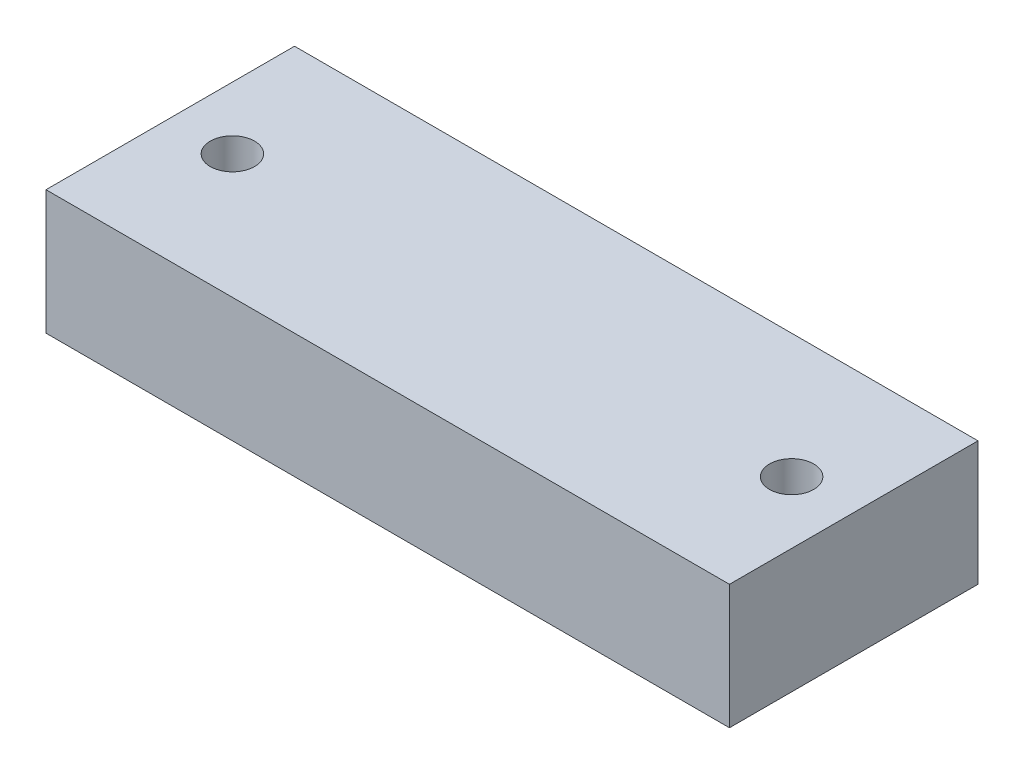
ISO-10303-21;
HEADER;
FILE_DESCRIPTION(('STEP AP214'),'2;1');
FILE_NAME('part.step','',(''),(''),'','','');
FILE_SCHEMA(('AUTOMOTIVE_DESIGN { 1 0 10303 214 1 1 1 1 }'));
ENDSEC;
DATA;
#1=APPLICATION_CONTEXT('core data for automotive mechanical design processes');
#2=APPLICATION_PROTOCOL_DEFINITION('international standard','automotive_design',2000,#1);
#3=PRODUCT_CONTEXT('',#1,'mechanical');
#4=PRODUCT('Part','Part','',(#3));
#5=PRODUCT_RELATED_PRODUCT_CATEGORY('part','',(#4));
#6=PRODUCT_DEFINITION_FORMATION('','',#4);
#7=PRODUCT_DEFINITION_CONTEXT('part definition',#1,'design');
#8=PRODUCT_DEFINITION('design','',#6,#7);
#9=PRODUCT_DEFINITION_SHAPE('','',#8);
#10=(LENGTH_UNIT() NAMED_UNIT(*) SI_UNIT(.MILLI.,.METRE.));
#11=(NAMED_UNIT(*) PLANE_ANGLE_UNIT() SI_UNIT($,.RADIAN.));
#12=(NAMED_UNIT(*) SI_UNIT($,.STERADIAN.) SOLID_ANGLE_UNIT());
#13=UNCERTAINTY_MEASURE_WITH_UNIT(LENGTH_MEASURE(1.E-05),#10,'distance_accuracy_value','');
#14=(GEOMETRIC_REPRESENTATION_CONTEXT(3) GLOBAL_UNCERTAINTY_ASSIGNED_CONTEXT((#13)) GLOBAL_UNIT_ASSIGNED_CONTEXT((#10,
#11,#12)) REPRESENTATION_CONTEXT('',''));
#15=CARTESIAN_POINT('',(0.,0.,0.));
#16=DIRECTION('',(0.,0.,1.));
#17=DIRECTION('',(1.,0.,0.));
#18=AXIS2_PLACEMENT_3D('',#15,#16,#17);
#19=CARTESIAN_POINT('',(17.4625,6.35,-6.35));
#20=DIRECTION('',(-1.,0.,0.));
#21=DIRECTION('',(0.,0.,1.));
#22=AXIS2_PLACEMENT_3D('',#19,#20,#21);
#23=PLANE('',#22);
#24=DIRECTION('',(0.,0.,-1.));
#25=VECTOR('',#24,1.);
#26=CARTESIAN_POINT('',(17.4625,0.,-6.35));
#27=LINE('',#26,#25);
#28=CARTESIAN_POINT('',(17.4625,0.,6.35));
#29=VERTEX_POINT('',#28);
#30=CARTESIAN_POINT('',(17.4625,0.,-6.35));
#31=VERTEX_POINT('',#30);
#32=EDGE_CURVE('E100',#29,#31,#27,.T.);
#33=ORIENTED_EDGE('',*,*,#32,.T.);
#34=DIRECTION('',(0.,-1.,0.));
#35=VECTOR('',#34,1.);
#36=CARTESIAN_POINT('',(17.4625,6.35,-6.35));
#37=LINE('',#36,#35);
#38=CARTESIAN_POINT('',(17.4625,6.35,-6.35));
#39=VERTEX_POINT('',#38);
#40=EDGE_CURVE('E11',#39,#31,#37,.T.);
#41=ORIENTED_EDGE('',*,*,#40,.F.);
#42=DIRECTION('',(0.,0.,-1.));
#43=VECTOR('',#42,1.);
#44=CARTESIAN_POINT('',(17.4625,6.35,-6.35));
#45=LINE('',#44,#43);
#46=CARTESIAN_POINT('',(17.4625,6.35,6.35));
#47=VERTEX_POINT('',#46);
#48=EDGE_CURVE('E88',#47,#39,#45,.T.);
#49=ORIENTED_EDGE('',*,*,#48,.F.);
#50=DIRECTION('',(0.,-1.,0.));
#51=VECTOR('',#50,1.);
#52=CARTESIAN_POINT('',(17.4625,6.35,6.35));
#53=LINE('',#52,#51);
#54=EDGE_CURVE('E96',#47,#29,#53,.T.);
#55=ORIENTED_EDGE('',*,*,#54,.T.);
#56=EDGE_LOOP('',(#33,#41,#49,#55));
#57=FACE_BOUND('',#56,.T.);
#58=ADVANCED_FACE('F37',(#57),#23,.F.);
#59=CARTESIAN_POINT('',(-17.4625,6.35,-6.35));
#60=DIRECTION('',(0.,0.,1.));
#61=DIRECTION('',(1.,0.,0.));
#62=AXIS2_PLACEMENT_3D('',#59,#60,#61);
#63=PLANE('',#62);
#64=DIRECTION('',(-1.,0.,0.));
#65=VECTOR('',#64,1.);
#66=CARTESIAN_POINT('',(-17.4625,0.,-6.35));
#67=LINE('',#66,#65);
#68=CARTESIAN_POINT('',(-17.4625,0.,-6.35));
#69=VERTEX_POINT('',#68);
#70=EDGE_CURVE('E92',#31,#69,#67,.T.);
#71=ORIENTED_EDGE('',*,*,#70,.T.);
#72=DIRECTION('',(0.,-1.,0.));
#73=VECTOR('',#72,1.);
#74=CARTESIAN_POINT('',(-17.4625,6.35,-6.35));
#75=LINE('',#74,#73);
#76=CARTESIAN_POINT('',(-17.4625,6.35,-6.35));
#77=VERTEX_POINT('',#76);
#78=EDGE_CURVE('E45',#77,#69,#75,.T.);
#79=ORIENTED_EDGE('',*,*,#78,.F.);
#80=DIRECTION('',(-1.,0.,0.));
#81=VECTOR('',#80,1.);
#82=CARTESIAN_POINT('',(-17.4625,6.35,-6.35));
#83=LINE('',#82,#81);
#84=EDGE_CURVE('E83',#39,#77,#83,.T.);
#85=ORIENTED_EDGE('',*,*,#84,.F.);
#86=ORIENTED_EDGE('',*,*,#40,.T.);
#87=EDGE_LOOP('',(#71,#79,#85,#86));
#88=FACE_BOUND('',#87,.T.);
#89=ADVANCED_FACE('F91',(#88),#63,.F.);
#90=CARTESIAN_POINT('',(-17.4625,6.35,-6.35));
#91=DIRECTION('',(1.,0.,0.));
#92=DIRECTION('',(0.,0.,-1.));
#93=AXIS2_PLACEMENT_3D('',#90,#91,#92);
#94=PLANE('',#93);
#95=DIRECTION('',(0.,0.,1.));
#96=VECTOR('',#95,1.);
#97=CARTESIAN_POINT('',(-17.4625,0.,-6.35));
#98=LINE('',#97,#96);
#99=CARTESIAN_POINT('',(-17.4625,0.,6.35));
#100=VERTEX_POINT('',#99);
#101=EDGE_CURVE('E70',#69,#100,#98,.T.);
#102=ORIENTED_EDGE('',*,*,#101,.T.);
#103=DIRECTION('',(0.,-1.,0.));
#104=VECTOR('',#103,1.);
#105=CARTESIAN_POINT('',(-17.4625,6.35,6.35));
#106=LINE('',#105,#104);
#107=CARTESIAN_POINT('',(-17.4625,6.35,6.35));
#108=VERTEX_POINT('',#107);
#109=EDGE_CURVE('E93',#108,#100,#106,.T.);
#110=ORIENTED_EDGE('',*,*,#109,.F.);
#111=DIRECTION('',(0.,0.,1.));
#112=VECTOR('',#111,1.);
#113=CARTESIAN_POINT('',(-17.4625,6.35,-6.35));
#114=LINE('',#113,#112);
#115=EDGE_CURVE('E86',#77,#108,#114,.T.);
#116=ORIENTED_EDGE('',*,*,#115,.F.);
#117=ORIENTED_EDGE('',*,*,#78,.T.);
#118=EDGE_LOOP('',(#102,#110,#116,#117));
#119=FACE_BOUND('',#118,.T.);
#120=ADVANCED_FACE('F94',(#119),#94,.F.);
#121=CARTESIAN_POINT('',(-17.4625,6.35,6.35));
#122=DIRECTION('',(0.,0.,-1.));
#123=DIRECTION('',(-1.,0.,0.));
#124=AXIS2_PLACEMENT_3D('',#121,#122,#123);
#125=PLANE('',#124);
#126=DIRECTION('',(1.,0.,0.));
#127=VECTOR('',#126,1.);
#128=CARTESIAN_POINT('',(-17.4625,0.,6.35));
#129=LINE('',#128,#127);
#130=EDGE_CURVE('E76',#100,#29,#129,.T.);
#131=ORIENTED_EDGE('',*,*,#130,.T.);
#132=ORIENTED_EDGE('',*,*,#54,.F.);
#133=DIRECTION('',(1.,0.,0.));
#134=VECTOR('',#133,1.);
#135=CARTESIAN_POINT('',(-17.4625,6.35,6.35));
#136=LINE('',#135,#134);
#137=EDGE_CURVE('E53',#108,#47,#136,.T.);
#138=ORIENTED_EDGE('',*,*,#137,.F.);
#139=ORIENTED_EDGE('',*,*,#109,.T.);
#140=EDGE_LOOP('',(#131,#132,#138,#139));
#141=FACE_BOUND('',#140,.T.);
#142=ADVANCED_FACE('F108',(#141),#125,.F.);
#143=CARTESIAN_POINT('',(0.,6.35,0.));
#144=DIRECTION('',(0.,1.,0.));
#145=DIRECTION('',(0.,0.,1.));
#146=AXIS2_PLACEMENT_3D('',#143,#144,#145);
#147=PLANE('',#146);
#148=CARTESIAN_POINT('',(-14.2875,6.35,0.));
#149=DIRECTION('',(0.,1.,0.));
#150=DIRECTION('',(0.,0.,1.));
#151=AXIS2_PLACEMENT_3D('',#148,#149,#150);
#152=CIRCLE('',#151,1.13029999999999);
#153=CARTESIAN_POINT('',(-14.2875,6.35,1.13030000000001));
#154=VERTEX_POINT('',#153);
#155=EDGE_CURVE('E122',#154,#154,#152,.T.);
#156=ORIENTED_EDGE('',*,*,#155,.F.);
#157=EDGE_LOOP('',(#156));
#158=FACE_BOUND('',#157,.T.);
#159=CARTESIAN_POINT('',(14.2875,6.35,0.));
#160=DIRECTION('',(0.,1.,0.));
#161=DIRECTION('',(0.,0.,1.));
#162=AXIS2_PLACEMENT_3D('',#159,#160,#161);
#163=CIRCLE('',#162,1.13029999999999);
#164=CARTESIAN_POINT('',(14.2875,6.35,1.13030000000001));
#165=VERTEX_POINT('',#164);
#166=EDGE_CURVE('E116',#165,#165,#163,.T.);
#167=ORIENTED_EDGE('',*,*,#166,.F.);
#168=EDGE_LOOP('',(#167));
#169=FACE_BOUND('',#168,.T.);
#170=ORIENTED_EDGE('',*,*,#48,.T.);
#171=ORIENTED_EDGE('',*,*,#84,.T.);
#172=ORIENTED_EDGE('',*,*,#115,.T.);
#173=ORIENTED_EDGE('',*,*,#137,.T.);
#174=EDGE_LOOP('',(#170,#171,#172,#173));
#175=FACE_BOUND('',#174,.T.);
#176=ADVANCED_FACE('F84',(#158,#169,#175),#147,.T.);
#177=CARTESIAN_POINT('',(0.,0.,0.));
#178=DIRECTION('',(0.,1.,0.));
#179=DIRECTION('',(0.,0.,1.));
#180=AXIS2_PLACEMENT_3D('',#177,#178,#179);
#181=PLANE('',#180);
#182=CARTESIAN_POINT('',(-14.2875,0.,0.));
#183=DIRECTION('',(0.,1.,0.));
#184=DIRECTION('',(0.,0.,1.));
#185=AXIS2_PLACEMENT_3D('',#182,#183,#184);
#186=CIRCLE('',#185,1.13029999999999);
#187=CARTESIAN_POINT('',(-14.2875,0.,1.13030000000001));
#188=VERTEX_POINT('',#187);
#189=EDGE_CURVE('E119',#188,#188,#186,.T.);
#190=ORIENTED_EDGE('',*,*,#189,.T.);
#191=EDGE_LOOP('',(#190));
#192=FACE_BOUND('',#191,.T.);
#193=CARTESIAN_POINT('',(14.2875,0.,0.));
#194=DIRECTION('',(0.,1.,0.));
#195=DIRECTION('',(0.,0.,1.));
#196=AXIS2_PLACEMENT_3D('',#193,#194,#195);
#197=CIRCLE('',#196,1.13029999999999);
#198=CARTESIAN_POINT('',(14.2875,0.,1.13030000000001));
#199=VERTEX_POINT('',#198);
#200=EDGE_CURVE('E103',#199,#199,#197,.T.);
#201=ORIENTED_EDGE('',*,*,#200,.T.);
#202=EDGE_LOOP('',(#201));
#203=FACE_BOUND('',#202,.T.);
#204=ORIENTED_EDGE('',*,*,#32,.F.);
#205=ORIENTED_EDGE('',*,*,#130,.F.);
#206=ORIENTED_EDGE('',*,*,#101,.F.);
#207=ORIENTED_EDGE('',*,*,#70,.F.);
#208=EDGE_LOOP('',(#204,#205,#206,#207));
#209=FACE_BOUND('',#208,.T.);
#210=ADVANCED_FACE('F111',(#192,#203,#209),#181,.F.);
#211=CARTESIAN_POINT('',(14.2875,6.35,0.));
#212=DIRECTION('',(0.,1.,0.));
#213=DIRECTION('',(0.,0.,1.));
#214=AXIS2_PLACEMENT_3D('',#211,#212,#213);
#215=CYLINDRICAL_SURFACE('',#214,1.13029999999999);
#216=ORIENTED_EDGE('',*,*,#200,.F.);
#217=EDGE_LOOP('',(#216));
#218=FACE_BOUND('',#217,.T.);
#219=ORIENTED_EDGE('',*,*,#166,.T.);
#220=EDGE_LOOP('',(#219));
#221=FACE_BOUND('',#220,.T.);
#222=ADVANCED_FACE('F133',(#218,#221),#215,.F.);
#223=CARTESIAN_POINT('',(-14.2875,6.35,0.));
#224=DIRECTION('',(0.,1.,0.));
#225=DIRECTION('',(0.,0.,1.));
#226=AXIS2_PLACEMENT_3D('',#223,#224,#225);
#227=CYLINDRICAL_SURFACE('',#226,1.13029999999999);
#228=ORIENTED_EDGE('',*,*,#189,.F.);
#229=EDGE_LOOP('',(#228));
#230=FACE_BOUND('',#229,.T.);
#231=ORIENTED_EDGE('',*,*,#155,.T.);
#232=EDGE_LOOP('',(#231));
#233=FACE_BOUND('',#232,.T.);
#234=ADVANCED_FACE('F126',(#230,#233),#227,.F.);
#235=CLOSED_SHELL('',(#58,#89,#120,#142,#176,#210,#222,#234));
#236=MANIFOLD_SOLID_BREP('B2',#235);
#237=ADVANCED_BREP_SHAPE_REPRESENTATION('',(#18,#236),#14);
#238=SHAPE_DEFINITION_REPRESENTATION(#9,#237);
ENDSEC;
END-ISO-10303-21;
